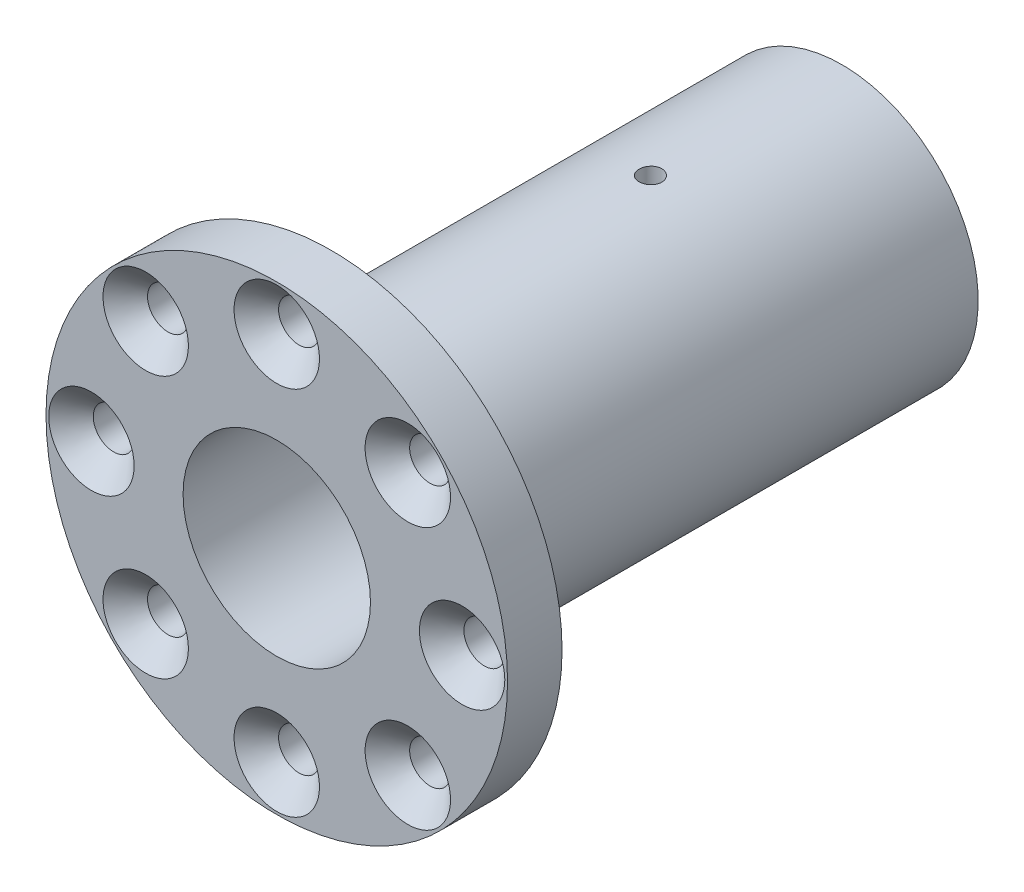
ISO-10303-21;
HEADER;
FILE_DESCRIPTION(('STEP AP214'),'2;1');
FILE_NAME('part.step','',(''),(''),'','','');
FILE_SCHEMA(('AUTOMOTIVE_DESIGN { 1 0 10303 214 1 1 1 1 }'));
ENDSEC;
DATA;
#1=APPLICATION_CONTEXT('core data for automotive mechanical design processes');
#2=APPLICATION_PROTOCOL_DEFINITION('international standard','automotive_design',2000,#1);
#3=PRODUCT_CONTEXT('',#1,'mechanical');
#4=PRODUCT('Part','Part','',(#3));
#5=PRODUCT_RELATED_PRODUCT_CATEGORY('part','',(#4));
#6=PRODUCT_DEFINITION_FORMATION('','',#4);
#7=PRODUCT_DEFINITION_CONTEXT('part definition',#1,'design');
#8=PRODUCT_DEFINITION('design','',#6,#7);
#9=PRODUCT_DEFINITION_SHAPE('','',#8);
#10=(LENGTH_UNIT() NAMED_UNIT(*) SI_UNIT(.MILLI.,.METRE.));
#11=(NAMED_UNIT(*) PLANE_ANGLE_UNIT() SI_UNIT($,.RADIAN.));
#12=(NAMED_UNIT(*) SI_UNIT($,.STERADIAN.) SOLID_ANGLE_UNIT());
#13=UNCERTAINTY_MEASURE_WITH_UNIT(LENGTH_MEASURE(1.E-05),#10,'distance_accuracy_value','');
#14=(GEOMETRIC_REPRESENTATION_CONTEXT(3) GLOBAL_UNCERTAINTY_ASSIGNED_CONTEXT((#13)) GLOBAL_UNIT_ASSIGNED_CONTEXT((#10,
#11,#12)) REPRESENTATION_CONTEXT('',''));
#15=CARTESIAN_POINT('',(0.,0.,0.));
#16=DIRECTION('',(0.,0.,1.));
#17=DIRECTION('',(1.,0.,0.));
#18=AXIS2_PLACEMENT_3D('',#15,#16,#17);
#19=CARTESIAN_POINT('',(-2.5,6.53834841531101,61.54));
#20=DIRECTION('',(-1.,0.,0.));
#21=DIRECTION('',(0.,0.,1.));
#22=AXIS2_PLACEMENT_3D('',#19,#20,#21);
#23=PLANE('',#22);
#24=DIRECTION('',(0.,1.,0.));
#25=VECTOR('',#24,1.);
#26=CARTESIAN_POINT('',(-2.5,6.53834841531101,23.44));
#27=LINE('',#26,#25);
#28=CARTESIAN_POINT('',(-2.5,6.54948151841044,23.44));
#29=VERTEX_POINT('',#28);
#30=CARTESIAN_POINT('',(-2.5,9.05849989544415,23.44));
#31=VERTEX_POINT('',#30);
#32=EDGE_CURVE('E78',#29,#31,#27,.T.);
#33=ORIENTED_EDGE('',*,*,#32,.F.);
#34=DIRECTION('',(0.,0.,-1.));
#35=VECTOR('',#34,1.);
#36=CARTESIAN_POINT('',(-2.5,6.54948151841044,61.54));
#37=LINE('',#36,#35);
#38=CARTESIAN_POINT('',(-2.5,6.54948151841044,-0.660000000000001));
#39=VERTEX_POINT('',#38);
#40=EDGE_CURVE('E83',#29,#39,#37,.T.);
#41=ORIENTED_EDGE('',*,*,#40,.T.);
#42=DIRECTION('',(0.,1.,0.));
#43=VECTOR('',#42,1.);
#44=CARTESIAN_POINT('',(-2.5,6.53834841531101,-0.660000000000001));
#45=LINE('',#44,#43);
#46=CARTESIAN_POINT('',(-2.5,9.05849989544415,-0.660000000000001));
#47=VERTEX_POINT('',#46);
#48=EDGE_CURVE('E93',#39,#47,#45,.T.);
#49=ORIENTED_EDGE('',*,*,#48,.T.);
#50=DIRECTION('',(0.,0.,-1.));
#51=VECTOR('',#50,1.);
#52=CARTESIAN_POINT('',(-2.5,9.05849989544415,61.54));
#53=LINE('',#52,#51);
#54=EDGE_CURVE('E59',#31,#47,#53,.T.);
#55=ORIENTED_EDGE('',*,*,#54,.F.);
#56=EDGE_LOOP('',(#33,#41,#49,#55));
#57=FACE_BOUND('',#56,.T.);
#58=ADVANCED_FACE('F36',(#57),#23,.F.);
#59=CARTESIAN_POINT('',(2.5,9.05849989544415,61.54));
#60=DIRECTION('',(1.,0.,0.));
#61=DIRECTION('',(0.,1.,0.));
#62=AXIS2_PLACEMENT_3D('',#59,#60,#61);
#63=PLANE('',#62);
#64=DIRECTION('',(0.,-1.,0.));
#65=VECTOR('',#64,1.);
#66=CARTESIAN_POINT('',(2.5,9.05849989544415,23.44));
#67=LINE('',#66,#65);
#68=CARTESIAN_POINT('',(2.5,9.05849989544415,23.44));
#69=VERTEX_POINT('',#68);
#70=CARTESIAN_POINT('',(2.5,6.54948151841044,23.44));
#71=VERTEX_POINT('',#70);
#72=EDGE_CURVE('E51',#69,#71,#67,.T.);
#73=ORIENTED_EDGE('',*,*,#72,.F.);
#74=DIRECTION('',(0.,0.,-1.));
#75=VECTOR('',#74,1.);
#76=CARTESIAN_POINT('',(2.5,9.05849989544415,61.54));
#77=LINE('',#76,#75);
#78=CARTESIAN_POINT('',(2.5,9.05849989544415,-0.660000000000001));
#79=VERTEX_POINT('',#78);
#80=EDGE_CURVE('E111',#69,#79,#77,.T.);
#81=ORIENTED_EDGE('',*,*,#80,.T.);
#82=DIRECTION('',(0.,-1.,0.));
#83=VECTOR('',#82,1.);
#84=CARTESIAN_POINT('',(2.5,9.05849989544415,-0.660000000000001));
#85=LINE('',#84,#83);
#86=CARTESIAN_POINT('',(2.5,6.54948151841044,-0.660000000000001));
#87=VERTEX_POINT('',#86);
#88=EDGE_CURVE('E107',#79,#87,#85,.T.);
#89=ORIENTED_EDGE('',*,*,#88,.T.);
#90=DIRECTION('',(0.,0.,-1.));
#91=VECTOR('',#90,1.);
#92=CARTESIAN_POINT('',(2.5,6.54948151841044,61.54));
#93=LINE('',#92,#91);
#94=EDGE_CURVE('E45',#87,#71,#93,.F.);
#95=ORIENTED_EDGE('',*,*,#94,.T.);
#96=EDGE_LOOP('',(#73,#81,#89,#95));
#97=FACE_BOUND('',#96,.T.);
#98=ADVANCED_FACE('F211',(#97),#63,.F.);
#99=CARTESIAN_POINT('',(-2.5,9.05849989544415,61.54));
#100=DIRECTION('',(0.,1.,0.));
#101=DIRECTION('',(0.,0.,1.));
#102=AXIS2_PLACEMENT_3D('',#99,#100,#101);
#103=PLANE('',#102);
#104=CARTESIAN_POINT('',(0.,9.05849989544415,20.422));
#105=DIRECTION('',(0.,-1.,0.));
#106=DIRECTION('',(0.,0.,-1.));
#107=AXIS2_PLACEMENT_3D('',#104,#105,#106);
#108=CIRCLE('',#107,1.24999999999999);
#109=CARTESIAN_POINT('',(0.,9.05849989544415,19.172));
#110=VERTEX_POINT('',#109);
#111=EDGE_CURVE('E144',#110,#110,#108,.T.);
#112=ORIENTED_EDGE('',*,*,#111,.F.);
#113=EDGE_LOOP('',(#112));
#114=FACE_BOUND('',#113,.T.);
#115=DIRECTION('',(1.,0.,0.));
#116=VECTOR('',#115,1.);
#117=CARTESIAN_POINT('',(-2.5,9.05849989544415,23.44));
#118=LINE('',#117,#116);
#119=EDGE_CURVE('E86',#31,#69,#118,.T.);
#120=ORIENTED_EDGE('',*,*,#119,.F.);
#121=ORIENTED_EDGE('',*,*,#54,.T.);
#122=DIRECTION('',(1.,0.,0.));
#123=VECTOR('',#122,1.);
#124=CARTESIAN_POINT('',(-2.5,9.05849989544415,-0.660000000000001));
#125=LINE('',#124,#123);
#126=EDGE_CURVE('E98',#47,#79,#125,.T.);
#127=ORIENTED_EDGE('',*,*,#126,.T.);
#128=ORIENTED_EDGE('',*,*,#80,.F.);
#129=EDGE_LOOP('',(#120,#121,#127,#128));
#130=FACE_BOUND('',#129,.T.);
#131=ADVANCED_FACE('F210',(#114,#130),#103,.F.);
#132=CARTESIAN_POINT('',(0.,0.,61.54));
#133=DIRECTION('',(0.,0.,-1.));
#134=DIRECTION('',(-1.,0.,0.));
#135=AXIS2_PLACEMENT_3D('',#132,#133,#134);
#136=CYLINDRICAL_SURFACE('',#135,7.01039999999999);
#137=CARTESIAN_POINT('',(0.,0.,23.44));
#138=DIRECTION('',(0.,0.,1.));
#139=DIRECTION('',(1.,0.,0.));
#140=AXIS2_PLACEMENT_3D('',#137,#138,#139);
#141=CIRCLE('',#140,7.01039999999999);
#142=EDGE_CURVE('E11',#71,#29,#141,.F.);
#143=ORIENTED_EDGE('',*,*,#142,.F.);
#144=ORIENTED_EDGE('',*,*,#94,.F.);
#145=CARTESIAN_POINT('',(0.,0.,-0.660000000000001));
#146=DIRECTION('',(0.,0.,-1.));
#147=DIRECTION('',(-1.,0.,0.));
#148=AXIS2_PLACEMENT_3D('',#145,#146,#147);
#149=CIRCLE('',#148,7.01039999999999);
#150=EDGE_CURVE('E90',#87,#39,#149,.T.);
#151=ORIENTED_EDGE('',*,*,#150,.T.);
#152=ORIENTED_EDGE('',*,*,#40,.F.);
#153=EDGE_LOOP('',(#143,#144,#151,#152));
#154=FACE_BOUND('',#153,.T.);
#155=ADVANCED_FACE('F88',(#154),#136,.F.);
#156=CARTESIAN_POINT('',(0.,0.,61.54));
#157=DIRECTION('',(0.,0.,-1.));
#158=DIRECTION('',(-1.,0.,0.));
#159=AXIS2_PLACEMENT_3D('',#156,#157,#158);
#160=CYLINDRICAL_SURFACE('',#159,25.4);
#161=CARTESIAN_POINT('',(0.,0.,61.54));
#162=DIRECTION('',(0.,0.,-1.));
#163=DIRECTION('',(-1.,0.,0.));
#164=AXIS2_PLACEMENT_3D('',#161,#162,#163);
#165=CIRCLE('',#164,25.4);
#166=CARTESIAN_POINT('',(-25.4,0.,61.54));
#167=VERTEX_POINT('',#166);
#168=EDGE_CURVE('E128',#167,#167,#165,.T.);
#169=ORIENTED_EDGE('',*,*,#168,.T.);
#170=EDGE_LOOP('',(#169));
#171=FACE_BOUND('',#170,.T.);
#172=CARTESIAN_POINT('',(0.,0.,55.54));
#173=DIRECTION('',(0.,0.,-1.));
#174=DIRECTION('',(-1.,0.,0.));
#175=AXIS2_PLACEMENT_3D('',#172,#173,#174);
#176=CIRCLE('',#175,25.4);
#177=CARTESIAN_POINT('',(-25.4,0.,55.54));
#178=VERTEX_POINT('',#177);
#179=EDGE_CURVE('E121',#178,#178,#176,.T.);
#180=ORIENTED_EDGE('',*,*,#179,.F.);
#181=EDGE_LOOP('',(#180));
#182=FACE_BOUND('',#181,.T.);
#183=ADVANCED_FACE('F38',(#171,#182),#160,.T.);
#184=CARTESIAN_POINT('',(25.4,0.,61.54));
#185=DIRECTION('',(0.,0.,1.));
#186=DIRECTION('',(1.,0.,0.));
#187=AXIS2_PLACEMENT_3D('',#184,#185,#186);
#188=PLANE('',#187);
#189=CARTESIAN_POINT('',(0.,0.,61.54));
#190=DIRECTION('',(0.,0.,1.));
#191=DIRECTION('',(1.,0.,0.));
#192=AXIS2_PLACEMENT_3D('',#189,#190,#191);
#193=CIRCLE('',#192,10.3124);
#194=CARTESIAN_POINT('',(10.3124,0.,61.54));
#195=VERTEX_POINT('',#194);
#196=EDGE_CURVE('E275',#195,#195,#193,.T.);
#197=ORIENTED_EDGE('',*,*,#196,.F.);
#198=EDGE_LOOP('',(#197));
#199=FACE_BOUND('',#198,.T.);
#200=CARTESIAN_POINT('',(0.,20.4,61.54));
#201=DIRECTION('',(0.,0.,1.));
#202=DIRECTION('',(1.,0.,0.));
#203=AXIS2_PLACEMENT_3D('',#200,#201,#202);
#204=CIRCLE('',#203,4.70000000001392);
#205=CARTESIAN_POINT('',(4.70000000001392,20.4,61.54));
#206=VERTEX_POINT('',#205);
#207=EDGE_CURVE('E279',#206,#206,#204,.T.);
#208=ORIENTED_EDGE('',*,*,#207,.F.);
#209=EDGE_LOOP('',(#208));
#210=FACE_BOUND('',#209,.T.);
#211=CARTESIAN_POINT('',(14.4249783362061,14.4249783362068,61.54));
#212=DIRECTION('',(0.,0.,1.));
#213=DIRECTION('',(1.,0.,0.));
#214=AXIS2_PLACEMENT_3D('',#211,#212,#213);
#215=CIRCLE('',#214,4.70000000001391);
#216=CARTESIAN_POINT('',(19.12497833622,14.4249783362068,61.54));
#217=VERTEX_POINT('',#216);
#218=EDGE_CURVE('E283',#217,#217,#215,.T.);
#219=ORIENTED_EDGE('',*,*,#218,.F.);
#220=EDGE_LOOP('',(#219));
#221=FACE_BOUND('',#220,.T.);
#222=CARTESIAN_POINT('',(20.4000000000017,1.73691033767046E-12,61.54));
#223=DIRECTION('',(0.,0.,1.));
#224=DIRECTION('',(1.,0.,0.));
#225=AXIS2_PLACEMENT_3D('',#222,#223,#224);
#226=CIRCLE('',#225,4.70000000001392);
#227=CARTESIAN_POINT('',(25.1000000000156,1.73691033767046E-12,61.54));
#228=VERTEX_POINT('',#227);
#229=EDGE_CURVE('E287',#228,#228,#226,.T.);
#230=ORIENTED_EDGE('',*,*,#229,.F.);
#231=EDGE_LOOP('',(#230));
#232=FACE_BOUND('',#231,.T.);
#233=CARTESIAN_POINT('',(14.4249783362085,-14.4249783362043,61.54));
#234=DIRECTION('',(0.,0.,1.));
#235=DIRECTION('',(1.,0.,0.));
#236=AXIS2_PLACEMENT_3D('',#233,#234,#235);
#237=CIRCLE('',#236,4.70000000001392);
#238=CARTESIAN_POINT('',(19.1249783362224,-14.4249783362043,61.54));
#239=VERTEX_POINT('',#238);
#240=EDGE_CURVE('E291',#239,#239,#237,.T.);
#241=ORIENTED_EDGE('',*,*,#240,.F.);
#242=EDGE_LOOP('',(#241));
#243=FACE_BOUND('',#242,.T.);
#244=CARTESIAN_POINT('',(3.47378376064356E-12,-20.4,61.54));
#245=DIRECTION('',(0.,0.,1.));
#246=DIRECTION('',(1.,0.,0.));
#247=AXIS2_PLACEMENT_3D('',#244,#245,#246);
#248=CIRCLE('',#247,4.70000000001392);
#249=CARTESIAN_POINT('',(4.70000000001739,-20.4,61.54));
#250=VERTEX_POINT('',#249);
#251=EDGE_CURVE('E295',#250,#250,#248,.T.);
#252=ORIENTED_EDGE('',*,*,#251,.F.);
#253=EDGE_LOOP('',(#252));
#254=FACE_BOUND('',#253,.T.);
#255=CARTESIAN_POINT('',(-14.4249783362026,-14.4249783362068,61.54));
#256=DIRECTION('',(0.,0.,1.));
#257=DIRECTION('',(1.,0.,0.));
#258=AXIS2_PLACEMENT_3D('',#255,#256,#257);
#259=CIRCLE('',#258,4.70000000001392);
#260=CARTESIAN_POINT('',(-9.72497833618869,-14.4249783362068,61.54));
#261=VERTEX_POINT('',#260);
#262=EDGE_CURVE('E299',#261,#261,#259,.T.);
#263=ORIENTED_EDGE('',*,*,#262,.F.);
#264=EDGE_LOOP('',(#263));
#265=FACE_BOUND('',#264,.T.);
#266=CARTESIAN_POINT('',(-20.3999999999983,-1.73940861714072E-12,61.54));
#267=DIRECTION('',(0.,0.,1.));
#268=DIRECTION('',(1.,0.,0.));
#269=AXIS2_PLACEMENT_3D('',#266,#267,#268);
#270=CIRCLE('',#269,4.70000000001392);
#271=CARTESIAN_POINT('',(-15.6999999999844,-1.73940861714072E-12,61.54));
#272=VERTEX_POINT('',#271);
#273=EDGE_CURVE('E303',#272,#272,#270,.T.);
#274=ORIENTED_EDGE('',*,*,#273,.F.);
#275=EDGE_LOOP('',(#274));
#276=FACE_BOUND('',#275,.T.);
#277=CARTESIAN_POINT('',(-14.4249783362051,14.4249783362043,61.54));
#278=DIRECTION('',(0.,0.,1.));
#279=DIRECTION('',(1.,0.,0.));
#280=AXIS2_PLACEMENT_3D('',#277,#278,#279);
#281=CIRCLE('',#280,4.70000000001392);
#282=CARTESIAN_POINT('',(-9.72497833619114,14.4249783362043,61.54));
#283=VERTEX_POINT('',#282);
#284=EDGE_CURVE('E306',#283,#283,#281,.T.);
#285=ORIENTED_EDGE('',*,*,#284,.F.);
#286=EDGE_LOOP('',(#285));
#287=FACE_BOUND('',#286,.T.);
#288=ORIENTED_EDGE('',*,*,#168,.F.);
#289=EDGE_LOOP('',(#288));
#290=FACE_BOUND('',#289,.T.);
#291=ADVANCED_FACE('F258',(#199,#210,#221,#232,#243,#254,#265,#276,#287,#290),#188,.T.);
#292=CARTESIAN_POINT('',(0.,0.,55.54));
#293=DIRECTION('',(0.,0.,-1.));
#294=DIRECTION('',(-1.,0.,0.));
#295=AXIS2_PLACEMENT_3D('',#292,#293,#294);
#296=PLANE('',#295);
#297=CARTESIAN_POINT('',(0.,20.4,55.54));
#298=DIRECTION('',(0.,0.,-1.));
#299=DIRECTION('',(-1.,0.,0.));
#300=AXIS2_PLACEMENT_3D('',#297,#298,#299);
#301=CIRCLE('',#300,2.24999999999998);
#302=CARTESIAN_POINT('',(-2.24999999999998,20.4,55.54));
#303=VERTEX_POINT('',#302);
#304=EDGE_CURVE('E409',#303,#303,#301,.T.);
#305=ORIENTED_EDGE('',*,*,#304,.F.);
#306=EDGE_LOOP('',(#305));
#307=FACE_BOUND('',#306,.T.);
#308=CARTESIAN_POINT('',(14.4249783362061,14.4249783362068,55.54));
#309=DIRECTION('',(0.,0.,-1.));
#310=DIRECTION('',(-1.,0.,0.));
#311=AXIS2_PLACEMENT_3D('',#308,#309,#310);
#312=CIRCLE('',#311,2.24999999999998);
#313=CARTESIAN_POINT('',(12.1749783362061,14.4249783362068,55.54));
#314=VERTEX_POINT('',#313);
#315=EDGE_CURVE('E405',#314,#314,#312,.T.);
#316=ORIENTED_EDGE('',*,*,#315,.F.);
#317=EDGE_LOOP('',(#316));
#318=FACE_BOUND('',#317,.T.);
#319=CARTESIAN_POINT('',(20.4000000000017,1.73691033767046E-12,55.54));
#320=DIRECTION('',(0.,0.,-1.));
#321=DIRECTION('',(-1.,0.,0.));
#322=AXIS2_PLACEMENT_3D('',#319,#320,#321);
#323=CIRCLE('',#322,2.24999999999998);
#324=CARTESIAN_POINT('',(18.1500000000018,1.73691033767046E-12,55.54));
#325=VERTEX_POINT('',#324);
#326=EDGE_CURVE('E367',#325,#325,#323,.T.);
#327=ORIENTED_EDGE('',*,*,#326,.F.);
#328=EDGE_LOOP('',(#327));
#329=FACE_BOUND('',#328,.T.);
#330=CARTESIAN_POINT('',(14.4249783362085,-14.4249783362043,55.54));
#331=DIRECTION('',(0.,0.,-1.));
#332=DIRECTION('',(-1.,0.,0.));
#333=AXIS2_PLACEMENT_3D('',#330,#331,#332);
#334=CIRCLE('',#333,2.24999999999998);
#335=CARTESIAN_POINT('',(12.1749783362086,-14.4249783362043,55.54));
#336=VERTEX_POINT('',#335);
#337=EDGE_CURVE('E363',#336,#336,#334,.T.);
#338=ORIENTED_EDGE('',*,*,#337,.F.);
#339=EDGE_LOOP('',(#338));
#340=FACE_BOUND('',#339,.T.);
#341=CARTESIAN_POINT('',(3.47378376064356E-12,-20.4,55.54));
#342=DIRECTION('',(0.,0.,-1.));
#343=DIRECTION('',(-1.,0.,0.));
#344=AXIS2_PLACEMENT_3D('',#341,#342,#343);
#345=CIRCLE('',#344,2.24999999999998);
#346=CARTESIAN_POINT('',(-2.24999999999651,-20.4,55.54));
#347=VERTEX_POINT('',#346);
#348=EDGE_CURVE('E382',#347,#347,#345,.T.);
#349=ORIENTED_EDGE('',*,*,#348,.F.);
#350=EDGE_LOOP('',(#349));
#351=FACE_BOUND('',#350,.T.);
#352=CARTESIAN_POINT('',(-14.4249783362026,-14.4249783362068,55.54));
#353=DIRECTION('',(0.,0.,-1.));
#354=DIRECTION('',(-1.,0.,0.));
#355=AXIS2_PLACEMENT_3D('',#352,#353,#354);
#356=CIRCLE('',#355,2.24999999999998);
#357=CARTESIAN_POINT('',(-16.6749783362026,-14.4249783362068,55.54));
#358=VERTEX_POINT('',#357);
#359=EDGE_CURVE('E388',#358,#358,#356,.T.);
#360=ORIENTED_EDGE('',*,*,#359,.F.);
#361=EDGE_LOOP('',(#360));
#362=FACE_BOUND('',#361,.T.);
#363=CARTESIAN_POINT('',(-20.3999999999983,-1.73940861714072E-12,55.54));
#364=DIRECTION('',(0.,0.,-1.));
#365=DIRECTION('',(-1.,0.,0.));
#366=AXIS2_PLACEMENT_3D('',#363,#364,#365);
#367=CIRCLE('',#366,2.24999999999998);
#368=CARTESIAN_POINT('',(-22.6499999999982,-1.73940861714072E-12,55.54));
#369=VERTEX_POINT('',#368);
#370=EDGE_CURVE('E310',#369,#369,#367,.T.);
#371=ORIENTED_EDGE('',*,*,#370,.F.);
#372=EDGE_LOOP('',(#371));
#373=FACE_BOUND('',#372,.T.);
#374=CARTESIAN_POINT('',(-14.4249783362051,14.4249783362043,55.54));
#375=DIRECTION('',(0.,0.,-1.));
#376=DIRECTION('',(-1.,0.,0.));
#377=AXIS2_PLACEMENT_3D('',#374,#375,#376);
#378=CIRCLE('',#377,2.24999999999998);
#379=CARTESIAN_POINT('',(-16.674978336205,14.4249783362043,55.54));
#380=VERTEX_POINT('',#379);
#381=EDGE_CURVE('E145',#380,#380,#378,.T.);
#382=ORIENTED_EDGE('',*,*,#381,.F.);
#383=EDGE_LOOP('',(#382));
#384=FACE_BOUND('',#383,.T.);
#385=CARTESIAN_POINT('',(0.,0.,55.54));
#386=DIRECTION('',(0.,0.,-1.));
#387=DIRECTION('',(-1.,0.,0.));
#388=AXIS2_PLACEMENT_3D('',#385,#386,#387);
#389=CIRCLE('',#388,15.);
#390=CARTESIAN_POINT('',(-15.,0.,55.54));
#391=VERTEX_POINT('',#390);
#392=EDGE_CURVE('E114',#391,#391,#389,.T.);
#393=ORIENTED_EDGE('',*,*,#392,.F.);
#394=EDGE_LOOP('',(#393));
#395=FACE_BOUND('',#394,.T.);
#396=ORIENTED_EDGE('',*,*,#179,.T.);
#397=EDGE_LOOP('',(#396));
#398=FACE_BOUND('',#397,.T.);
#399=ADVANCED_FACE('F224',(#307,#318,#329,#340,#351,#362,#373,#384,#395,#398),#296,.T.);
#400=CARTESIAN_POINT('',(0.,0.,-0.660000000000001));
#401=DIRECTION('',(0.,0.,1.));
#402=DIRECTION('',(1.,0.,0.));
#403=AXIS2_PLACEMENT_3D('',#400,#401,#402);
#404=CYLINDRICAL_SURFACE('',#403,15.);
#405=CARTESIAN_POINT('',(0.,15.,19.172));
#406=CARTESIAN_POINT('',(0.0700826124015046,14.999999317644,19.1720030610329));
#407=CARTESIAN_POINT('',(0.140212933975281,14.9995036067925,19.1779137122638));
#408=CARTESIAN_POINT('',(0.278533213375484,14.9975737791031,19.2014054398189));
#409=CARTESIAN_POINT('',(0.346720881531534,14.9961385991462,19.2189997378811));
#410=CARTESIAN_POINT('',(0.479132528142821,14.9924920155763,19.2653464422617));
#411=CARTESIAN_POINT('',(0.543358725530763,14.9902810512311,19.2940925351373));
#412=CARTESIAN_POINT('',(0.666059041770088,14.9853308468089,19.36191553984));
#413=CARTESIAN_POINT('',(0.724534387356729,14.982591719767,19.4009902418469));
#414=CARTESIAN_POINT('',(0.83423749995698,14.9768847483339,19.4884688332575));
#415=CARTESIAN_POINT('',(0.885448590520192,14.9739164010822,19.5368936049196));
#416=CARTESIAN_POINT('',(0.979026416920682,14.9680897600396,19.6416536198124));
#417=CARTESIAN_POINT('',(1.02139276421437,14.965231471088,19.6979892103783));
#418=CARTESIAN_POINT('',(1.09613490298778,14.9599431582655,19.8170726463738));
#419=CARTESIAN_POINT('',(1.12849604118942,14.9575137647512,19.8798297192535));
#420=CARTESIAN_POINT('',(1.18221554221729,14.9533640556034,20.009910369445));
#421=CARTESIAN_POINT('',(1.20357409939051,14.9516437274454,20.0772338660728));
#422=CARTESIAN_POINT('',(1.2346337872732,14.949111150829,20.2143692398515));
#423=CARTESIAN_POINT('',(1.24436208173721,14.9482967867028,20.2841749249908));
#424=CARTESIAN_POINT('',(1.25196901001927,14.9476616540185,20.4244327549317));
#425=CARTESIAN_POINT('',(1.24984786622441,14.9478408668133,20.4948848875763));
#426=CARTESIAN_POINT('',(1.23383858026855,14.9491707170205,20.6342495818882));
#427=CARTESIAN_POINT('',(1.21997996004756,14.9503189172232,20.7031655613455));
#428=CARTESIAN_POINT('',(1.18093498172866,14.9534535446171,20.8376898342412));
#429=CARTESIAN_POINT('',(1.15574851299597,14.955439979995,20.9032980953673));
#430=CARTESIAN_POINT('',(1.09472973519003,14.9600300588357,21.0294386323476));
#431=CARTESIAN_POINT('',(1.05888418094648,14.9626344693871,21.0899644719844));
#432=CARTESIAN_POINT('',(0.977574304891675,14.9681663357985,21.2041516735248));
#433=CARTESIAN_POINT('',(0.932109788278167,14.9710937982004,21.2578128963715));
#434=CARTESIAN_POINT('',(0.832686977782944,14.9769527551456,21.3569192741019));
#435=CARTESIAN_POINT('',(0.77870316173821,14.9798842346883,21.4023388301616));
#436=CARTESIAN_POINT('',(0.663863195464681,14.9854123983729,21.4834746542357));
#437=CARTESIAN_POINT('',(0.603007040644165,14.9880090822911,21.5191909157669));
#438=CARTESIAN_POINT('',(0.476133241584809,14.9925755726205,21.5799047033359));
#439=CARTESIAN_POINT('',(0.410115052261338,14.9945453127181,21.6049010955977));
#440=CARTESIAN_POINT('',(0.274798836274474,14.9976352176475,21.6434476655641));
#441=CARTESIAN_POINT('',(0.205500877711066,14.9987554001111,21.6569980808191));
#442=CARTESIAN_POINT('',(0.0658141252053123,15.0000177117881,21.672235955052));
#443=CARTESIAN_POINT('',(-0.0045707863939955,15.00016275615,21.6739587726336));
#444=CARTESIAN_POINT('',(-0.144628440629128,14.9994662347338,21.6655851742158));
#445=CARTESIAN_POINT('',(-0.214301189901765,14.9986246781584,21.6554888684632));
#446=CARTESIAN_POINT('',(-0.350855945280871,14.9960514730165,21.6237929267374));
#447=CARTESIAN_POINT('',(-0.417741781424648,14.9943210927178,21.6022096799677));
#448=CARTESIAN_POINT('',(-0.546942706353105,14.9901646264044,21.5481692652724));
#449=CARTESIAN_POINT('',(-0.609257722853909,14.9877385293905,21.5157119254269));
#450=CARTESIAN_POINT('',(-0.727709022877376,14.9824553299204,21.4407558134795));
#451=CARTESIAN_POINT('',(-0.783830438151828,14.9795972277342,21.3982336170065));
#452=CARTESIAN_POINT('',(-0.888151368554517,14.9737744829962,21.3043886786869));
#453=CARTESIAN_POINT('',(-0.93635074601797,14.9708098385941,21.2530657839384));
#454=CARTESIAN_POINT('',(-1.02358068181887,14.9650995151978,21.1429228847521));
#455=CARTESIAN_POINT('',(-1.06258816654204,14.9623543984278,21.0840845735032));
#456=CARTESIAN_POINT('',(-1.13016882854939,14.957401896804,20.9606721714207));
#457=CARTESIAN_POINT('',(-1.15874211001244,14.9551945065815,20.8960981378626));
#458=CARTESIAN_POINT('',(-1.20460397180069,14.9515705356118,20.7631290118259));
#459=CARTESIAN_POINT('',(-1.2219066768116,14.9501529653579,20.6947388191071));
#460=CARTESIAN_POINT('',(-1.24478221238768,14.9482658211357,20.556011625157));
#461=CARTESIAN_POINT('',(-1.25035526821032,14.9477962289621,20.485674661338));
#462=CARTESIAN_POINT('',(-1.24961070361365,14.9478584743774,20.3452798424739));
#463=CARTESIAN_POINT('',(-1.24332933722173,14.9483872586634,20.2752217909545));
#464=CARTESIAN_POINT('',(-1.21912982911878,14.9503801885288,20.1371593330614));
#465=CARTESIAN_POINT('',(-1.20121166965952,14.951844335535,20.0691549298202));
#466=CARTESIAN_POINT('',(-1.15425638752132,14.9555422141463,19.9371277959167));
#467=CARTESIAN_POINT('',(-1.12521991750816,14.9577759005774,19.8731048317929));
#468=CARTESIAN_POINT('',(-1.05685632368405,14.9627612484384,19.7508364492829));
#469=CARTESIAN_POINT('',(-1.01752936139319,14.9655129017381,19.6925909402333));
#470=CARTESIAN_POINT('',(-0.929564927653049,14.9712341462335,19.5833453262337));
#471=CARTESIAN_POINT('',(-0.880900617176813,14.9742043500718,19.5323668641783));
#472=CARTESIAN_POINT('',(-0.775691531990572,14.980022437621,19.4392810184959));
#473=CARTESIAN_POINT('',(-0.719144853301355,14.9828702915603,19.39717578438));
#474=CARTESIAN_POINT('',(-0.59966721628676,14.9881279355284,19.3229751744781));
#475=CARTESIAN_POINT('',(-0.536724570338166,14.9905369002888,19.2908985766796));
#476=CARTESIAN_POINT('',(-0.406369689994662,14.9946356564538,19.2378102461859));
#477=CARTESIAN_POINT('',(-0.33896269426706,14.9963262741032,19.2167857946399));
#478=CARTESIAN_POINT('',(-0.225965060120847,14.9983638466732,19.1917530218725));
#479=CARTESIAN_POINT('',(-0.181101118048087,14.9989746109619,19.1843554843532));
#480=CARTESIAN_POINT('',(-0.0908314643764523,14.9997929082329,19.1744779879035));
#481=CARTESIAN_POINT('',(-0.0454257542163059,15.0000004422857,19.1719980159169));
#482=CARTESIAN_POINT('',(0.,15.,19.172));
#483=B_SPLINE_CURVE_WITH_KNOTS('',3,(#405,#406,#407,#408,#409,#410,#411,#412,#413,#414,#415,
#416,#417,#418,#419,#420,#421,#422,#423,#424,#425,#426,#427,#428,#429,#430,#431,#432,#433,#434,
#435,#436,#437,#438,#439,#440,#441,#442,#443,#444,#445,#446,#447,#448,#449,#450,#451,#452,#453,
#454,#455,#456,#457,#458,#459,#460,#461,#462,#463,#464,#465,#466,#467,#468,#469,#470,#471,#472,
#473,#474,#475,#476,#477,#478,#479,#480,#481,#482),.UNSPECIFIED.,.T.,.F.,(4,2,2,2,2,2,2,2,2,2,2,
2,2,2,2,2,2,2,2,2,2,2,2,2,2,2,2,2,2,2,2,2,2,2,2,2,2,2,4),(0.,0.210081983500172,0.42040211124729,
0.630603342361185,0.840759636980218,1.05139083598219,1.26203128592413,1.47297878688863,
1.68392256159874,1.89437268539481,2.10481885953272,2.3147372888786,2.52465776846246,
2.73484019686122,2.94502688226072,3.15585563668934,3.36668453198303,3.57753571988059,
3.78838253165665,3.99859874133957,4.20881299017772,4.41872811288477,4.62864655451711,
4.83905843718653,5.04947397589058,5.26041220613997,5.4713483302478,5.68201959051155,
5.89268680498441,6.10271078603153,6.31273508740418,6.52274706184397,6.73275574012314,
6.94337735830792,7.15404994040594,7.36511466328185,7.57593595739724,7.7121060794582,
7.84827583998425),.UNSPECIFIED.);
#484=CARTESIAN_POINT('',(0.,15.,19.172));
#485=VERTEX_POINT('',#484);
#486=EDGE_CURVE('E134',#485,#485,#483,.T.);
#487=ORIENTED_EDGE('',*,*,#486,.T.);
#488=EDGE_LOOP('',(#487));
#489=FACE_BOUND('',#488,.T.);
#490=CARTESIAN_POINT('',(0.,0.,-0.660000000000001));
#491=DIRECTION('',(0.,0.,-1.));
#492=DIRECTION('',(-1.,0.,0.));
#493=AXIS2_PLACEMENT_3D('',#490,#491,#492);
#494=CIRCLE('',#493,15.);
#495=CARTESIAN_POINT('',(-15.,0.,-0.660000000000001));
#496=VERTEX_POINT('',#495);
#497=EDGE_CURVE('E117',#496,#496,#494,.T.);
#498=ORIENTED_EDGE('',*,*,#497,.F.);
#499=EDGE_LOOP('',(#498));
#500=FACE_BOUND('',#499,.T.);
#501=ORIENTED_EDGE('',*,*,#392,.T.);
#502=EDGE_LOOP('',(#501));
#503=FACE_BOUND('',#502,.T.);
#504=ADVANCED_FACE('F147',(#489,#500,#503),#404,.T.);
#505=CARTESIAN_POINT('',(0.,0.,-0.660000000000001));
#506=DIRECTION('',(0.,0.,-1.));
#507=DIRECTION('',(-1.,0.,0.));
#508=AXIS2_PLACEMENT_3D('',#505,#506,#507);
#509=PLANE('',#508);
#510=CARTESIAN_POINT('',(11.4999999999991,-7.61616736356426E-13,-0.660000000000002));
#511=DIRECTION('',(0.,0.,-1.));
#512=DIRECTION('',(-1.,0.,0.));
#513=AXIS2_PLACEMENT_3D('',#510,#511,#512);
#514=CIRCLE('',#513,1.24999999999999);
#515=CARTESIAN_POINT('',(10.2499999999991,-7.61616736356426E-13,-0.660000000000002));
#516=VERTEX_POINT('',#515);
#517=EDGE_CURVE('E143',#516,#516,#514,.T.);
#518=ORIENTED_EDGE('',*,*,#517,.F.);
#519=EDGE_LOOP('',(#518));
#520=FACE_BOUND('',#519,.T.);
#521=CARTESIAN_POINT('',(5.74999999999794,-9.95929214352135,-0.660000000000002));
#522=DIRECTION('',(0.,0.,-1.));
#523=DIRECTION('',(-1.,0.,0.));
#524=AXIS2_PLACEMENT_3D('',#521,#522,#523);
#525=CIRCLE('',#524,1.24999999999999);
#526=CARTESIAN_POINT('',(4.49999999999795,-9.95929214352135,-0.660000000000002));
#527=VERTEX_POINT('',#526);
#528=EDGE_CURVE('E232',#527,#527,#525,.T.);
#529=ORIENTED_EDGE('',*,*,#528,.F.);
#530=EDGE_LOOP('',(#529));
#531=FACE_BOUND('',#530,.T.);
#532=CARTESIAN_POINT('',(-5.75000000000222,-9.95929214352015,-0.660000000000002));
#533=DIRECTION('',(0.,0.,-1.));
#534=DIRECTION('',(-1.,0.,0.));
#535=AXIS2_PLACEMENT_3D('',#532,#533,#534);
#536=CIRCLE('',#535,1.24999999999999);
#537=CARTESIAN_POINT('',(-7.00000000000221,-9.95929214352015,-0.660000000000002));
#538=VERTEX_POINT('',#537);
#539=EDGE_CURVE('E236',#538,#538,#536,.T.);
#540=ORIENTED_EDGE('',*,*,#539,.F.);
#541=EDGE_LOOP('',(#540));
#542=FACE_BOUND('',#541,.T.);
#543=CARTESIAN_POINT('',(-11.5000000000013,1.64225995095778E-12,-0.660000000000002));
#544=DIRECTION('',(0.,0.,-1.));
#545=DIRECTION('',(-1.,0.,0.));
#546=AXIS2_PLACEMENT_3D('',#543,#544,#545);
#547=CIRCLE('',#546,1.24999999999999);
#548=CARTESIAN_POINT('',(-12.7500000000013,1.64225995095778E-12,-0.660000000000002));
#549=VERTEX_POINT('',#548);
#550=EDGE_CURVE('E240',#549,#549,#547,.T.);
#551=ORIENTED_EDGE('',*,*,#550,.F.);
#552=EDGE_LOOP('',(#551));
#553=FACE_BOUND('',#552,.T.);
#554=CARTESIAN_POINT('',(-5.75000000000015,9.95929214352223,-0.660000000000002));
#555=DIRECTION('',(0.,0.,-1.));
#556=DIRECTION('',(-1.,0.,0.));
#557=AXIS2_PLACEMENT_3D('',#554,#555,#556);
#558=CIRCLE('',#557,1.24999999999999);
#559=CARTESIAN_POINT('',(-7.00000000000014,9.95929214352223,-0.660000000000002));
#560=VERTEX_POINT('',#559);
#561=EDGE_CURVE('E244',#560,#560,#558,.T.);
#562=ORIENTED_EDGE('',*,*,#561,.F.);
#563=EDGE_LOOP('',(#562));
#564=FACE_BOUND('',#563,.T.);
#565=CARTESIAN_POINT('',(5.75000000000002,9.95929214352104,-0.660000000000002));
#566=DIRECTION('',(0.,0.,-1.));
#567=DIRECTION('',(-1.,0.,0.));
#568=AXIS2_PLACEMENT_3D('',#565,#566,#567);
#569=CIRCLE('',#568,1.24999999999999);
#570=CARTESIAN_POINT('',(4.50000000000003,9.95929214352104,-0.660000000000002));
#571=VERTEX_POINT('',#570);
#572=EDGE_CURVE('E248',#571,#571,#569,.T.);
#573=ORIENTED_EDGE('',*,*,#572,.F.);
#574=EDGE_LOOP('',(#573));
#575=FACE_BOUND('',#574,.T.);
#576=ORIENTED_EDGE('',*,*,#150,.F.);
#577=ORIENTED_EDGE('',*,*,#88,.F.);
#578=ORIENTED_EDGE('',*,*,#126,.F.);
#579=ORIENTED_EDGE('',*,*,#48,.F.);
#580=EDGE_LOOP('',(#576,#577,#578,#579));
#581=FACE_BOUND('',#580,.T.);
#582=ORIENTED_EDGE('',*,*,#497,.T.);
#583=EDGE_LOOP('',(#582));
#584=FACE_BOUND('',#583,.T.);
#585=ADVANCED_FACE('F206',(#520,#531,#542,#553,#564,#575,#581,#584),#509,.T.);
#586=CARTESIAN_POINT('',(5.75000000000001,9.95929214352104,11.34));
#587=DIRECTION('',(0.,0.,1.));
#588=DIRECTION('',(1.,0.,0.));
#589=AXIS2_PLACEMENT_3D('',#586,#587,#588);
#590=PLANE('',#589);
#591=CARTESIAN_POINT('',(5.75000000000002,9.95929214352104,11.34));
#592=DIRECTION('',(0.,0.,-1.));
#593=DIRECTION('',(-1.,0.,0.));
#594=AXIS2_PLACEMENT_3D('',#591,#592,#593);
#595=CIRCLE('',#594,1.24999999999999);
#596=CARTESIAN_POINT('',(4.50000000000003,9.95929214352104,11.34));
#597=VERTEX_POINT('',#596);
#598=EDGE_CURVE('E101',#597,#597,#595,.T.);
#599=ORIENTED_EDGE('',*,*,#598,.T.);
#600=EDGE_LOOP('',(#599));
#601=FACE_BOUND('',#600,.T.);
#602=ADVANCED_FACE('F202',(#601),#590,.F.);
#603=CARTESIAN_POINT('',(5.75000000000002,9.95929214352104,-0.660000000000001));
#604=DIRECTION('',(0.,0.,-1.));
#605=DIRECTION('',(-1.,0.,0.));
#606=AXIS2_PLACEMENT_3D('',#603,#604,#605);
#607=CYLINDRICAL_SURFACE('',#606,1.24999999999999);
#608=ORIENTED_EDGE('',*,*,#598,.F.);
#609=EDGE_LOOP('',(#608));
#610=FACE_BOUND('',#609,.T.);
#611=ORIENTED_EDGE('',*,*,#572,.T.);
#612=EDGE_LOOP('',(#611));
#613=FACE_BOUND('',#612,.T.);
#614=ADVANCED_FACE('F198',(#610,#613),#607,.F.);
#615=CARTESIAN_POINT('',(-5.75000000000015,9.95929214352223,11.34));
#616=DIRECTION('',(0.,0.,1.));
#617=DIRECTION('',(1.,0.,0.));
#618=AXIS2_PLACEMENT_3D('',#615,#616,#617);
#619=PLANE('',#618);
#620=CARTESIAN_POINT('',(-5.75000000000015,9.95929214352223,11.34));
#621=DIRECTION('',(0.,0.,-1.));
#622=DIRECTION('',(-1.,0.,0.));
#623=AXIS2_PLACEMENT_3D('',#620,#621,#622);
#624=CIRCLE('',#623,1.24999999999999);
#625=CARTESIAN_POINT('',(-7.00000000000014,9.95929214352223,11.34));
#626=VERTEX_POINT('',#625);
#627=EDGE_CURVE('E351',#626,#626,#624,.T.);
#628=ORIENTED_EDGE('',*,*,#627,.T.);
#629=EDGE_LOOP('',(#628));
#630=FACE_BOUND('',#629,.T.);
#631=ADVANCED_FACE('F194',(#630),#619,.F.);
#632=CARTESIAN_POINT('',(-5.75000000000015,9.95929214352223,-0.660000000000001));
#633=DIRECTION('',(0.,0.,-1.));
#634=DIRECTION('',(-1.,0.,0.));
#635=AXIS2_PLACEMENT_3D('',#632,#633,#634);
#636=CYLINDRICAL_SURFACE('',#635,1.24999999999999);
#637=ORIENTED_EDGE('',*,*,#627,.F.);
#638=EDGE_LOOP('',(#637));
#639=FACE_BOUND('',#638,.T.);
#640=ORIENTED_EDGE('',*,*,#561,.T.);
#641=EDGE_LOOP('',(#640));
#642=FACE_BOUND('',#641,.T.);
#643=ADVANCED_FACE('F190',(#639,#642),#636,.F.);
#644=CARTESIAN_POINT('',(-11.5000000000013,1.64225995095778E-12,11.34));
#645=DIRECTION('',(0.,0.,1.));
#646=DIRECTION('',(1.,0.,0.));
#647=AXIS2_PLACEMENT_3D('',#644,#645,#646);
#648=PLANE('',#647);
#649=CARTESIAN_POINT('',(-11.5000000000013,1.64225995095778E-12,11.34));
#650=DIRECTION('',(0.,0.,-1.));
#651=DIRECTION('',(-1.,0.,0.));
#652=AXIS2_PLACEMENT_3D('',#649,#650,#651);
#653=CIRCLE('',#652,1.24999999999999);
#654=CARTESIAN_POINT('',(-12.7500000000013,1.64225995095778E-12,11.34));
#655=VERTEX_POINT('',#654);
#656=EDGE_CURVE('E345',#655,#655,#653,.T.);
#657=ORIENTED_EDGE('',*,*,#656,.T.);
#658=EDGE_LOOP('',(#657));
#659=FACE_BOUND('',#658,.T.);
#660=ADVANCED_FACE('F186',(#659),#648,.F.);
#661=CARTESIAN_POINT('',(-11.5000000000013,1.64225995095778E-12,-0.660000000000001));
#662=DIRECTION('',(0.,0.,-1.));
#663=DIRECTION('',(-1.,0.,0.));
#664=AXIS2_PLACEMENT_3D('',#661,#662,#663);
#665=CYLINDRICAL_SURFACE('',#664,1.24999999999999);
#666=ORIENTED_EDGE('',*,*,#656,.F.);
#667=EDGE_LOOP('',(#666));
#668=FACE_BOUND('',#667,.T.);
#669=ORIENTED_EDGE('',*,*,#550,.T.);
#670=EDGE_LOOP('',(#669));
#671=FACE_BOUND('',#670,.T.);
#672=ADVANCED_FACE('F182',(#668,#671),#665,.F.);
#673=CARTESIAN_POINT('',(-5.75000000000223,-9.95929214352015,11.34));
#674=DIRECTION('',(0.,0.,1.));
#675=DIRECTION('',(1.,0.,0.));
#676=AXIS2_PLACEMENT_3D('',#673,#674,#675);
#677=PLANE('',#676);
#678=CARTESIAN_POINT('',(-5.75000000000222,-9.95929214352015,11.34));
#679=DIRECTION('',(0.,0.,-1.));
#680=DIRECTION('',(-1.,0.,0.));
#681=AXIS2_PLACEMENT_3D('',#678,#679,#680);
#682=CIRCLE('',#681,1.24999999999999);
#683=CARTESIAN_POINT('',(-7.00000000000221,-9.95929214352015,11.34));
#684=VERTEX_POINT('',#683);
#685=EDGE_CURVE('E339',#684,#684,#682,.T.);
#686=ORIENTED_EDGE('',*,*,#685,.T.);
#687=EDGE_LOOP('',(#686));
#688=FACE_BOUND('',#687,.T.);
#689=ADVANCED_FACE('F178',(#688),#677,.F.);
#690=CARTESIAN_POINT('',(-5.75000000000222,-9.95929214352015,-0.660000000000001));
#691=DIRECTION('',(0.,0.,-1.));
#692=DIRECTION('',(-1.,0.,0.));
#693=AXIS2_PLACEMENT_3D('',#690,#691,#692);
#694=CYLINDRICAL_SURFACE('',#693,1.24999999999999);
#695=ORIENTED_EDGE('',*,*,#685,.F.);
#696=EDGE_LOOP('',(#695));
#697=FACE_BOUND('',#696,.T.);
#698=ORIENTED_EDGE('',*,*,#539,.T.);
#699=EDGE_LOOP('',(#698));
#700=FACE_BOUND('',#699,.T.);
#701=ADVANCED_FACE('F174',(#697,#700),#694,.F.);
#702=CARTESIAN_POINT('',(5.74999999999794,-9.95929214352135,11.34));
#703=DIRECTION('',(0.,0.,1.));
#704=DIRECTION('',(1.,0.,0.));
#705=AXIS2_PLACEMENT_3D('',#702,#703,#704);
#706=PLANE('',#705);
#707=CARTESIAN_POINT('',(5.74999999999794,-9.95929214352135,11.34));
#708=DIRECTION('',(0.,0.,-1.));
#709=DIRECTION('',(-1.,0.,0.));
#710=AXIS2_PLACEMENT_3D('',#707,#708,#709);
#711=CIRCLE('',#710,1.24999999999999);
#712=CARTESIAN_POINT('',(4.49999999999795,-9.95929214352135,11.34));
#713=VERTEX_POINT('',#712);
#714=EDGE_CURVE('E333',#713,#713,#711,.T.);
#715=ORIENTED_EDGE('',*,*,#714,.T.);
#716=EDGE_LOOP('',(#715));
#717=FACE_BOUND('',#716,.T.);
#718=ADVANCED_FACE('F170',(#717),#706,.F.);
#719=CARTESIAN_POINT('',(5.74999999999794,-9.95929214352135,-0.660000000000001));
#720=DIRECTION('',(0.,0.,-1.));
#721=DIRECTION('',(-1.,0.,0.));
#722=AXIS2_PLACEMENT_3D('',#719,#720,#721);
#723=CYLINDRICAL_SURFACE('',#722,1.24999999999999);
#724=ORIENTED_EDGE('',*,*,#714,.F.);
#725=EDGE_LOOP('',(#724));
#726=FACE_BOUND('',#725,.T.);
#727=ORIENTED_EDGE('',*,*,#528,.T.);
#728=EDGE_LOOP('',(#727));
#729=FACE_BOUND('',#728,.T.);
#730=ADVANCED_FACE('F166',(#726,#729),#723,.F.);
#731=CARTESIAN_POINT('',(11.4999999999991,-7.61616736356426E-13,11.34));
#732=DIRECTION('',(0.,0.,1.));
#733=DIRECTION('',(1.,0.,0.));
#734=AXIS2_PLACEMENT_3D('',#731,#732,#733);
#735=PLANE('',#734);
#736=CARTESIAN_POINT('',(11.4999999999991,-7.61616736356426E-13,11.34));
#737=DIRECTION('',(0.,0.,-1.));
#738=DIRECTION('',(-1.,0.,0.));
#739=AXIS2_PLACEMENT_3D('',#736,#737,#738);
#740=CIRCLE('',#739,1.24999999999999);
#741=CARTESIAN_POINT('',(10.2499999999991,-7.61616736356426E-13,11.34));
#742=VERTEX_POINT('',#741);
#743=EDGE_CURVE('E327',#742,#742,#740,.T.);
#744=ORIENTED_EDGE('',*,*,#743,.T.);
#745=EDGE_LOOP('',(#744));
#746=FACE_BOUND('',#745,.T.);
#747=ADVANCED_FACE('F162',(#746),#735,.F.);
#748=CARTESIAN_POINT('',(11.4999999999991,-7.61616736356426E-13,-0.660000000000001));
#749=DIRECTION('',(0.,0.,-1.));
#750=DIRECTION('',(-1.,0.,0.));
#751=AXIS2_PLACEMENT_3D('',#748,#749,#750);
#752=CYLINDRICAL_SURFACE('',#751,1.24999999999999);
#753=ORIENTED_EDGE('',*,*,#743,.F.);
#754=EDGE_LOOP('',(#753));
#755=FACE_BOUND('',#754,.T.);
#756=ORIENTED_EDGE('',*,*,#517,.T.);
#757=EDGE_LOOP('',(#756));
#758=FACE_BOUND('',#757,.T.);
#759=ADVANCED_FACE('F157',(#755,#758),#752,.F.);
#760=CARTESIAN_POINT('',(0.,9.05849989544415,20.422));
#761=DIRECTION('',(0.,-1.,0.));
#762=DIRECTION('',(0.,0.,-1.));
#763=AXIS2_PLACEMENT_3D('',#760,#761,#762);
#764=CYLINDRICAL_SURFACE('',#763,1.24999999999999);
#765=ORIENTED_EDGE('',*,*,#111,.T.);
#766=EDGE_LOOP('',(#765));
#767=FACE_BOUND('',#766,.T.);
#768=ORIENTED_EDGE('',*,*,#486,.F.);
#769=EDGE_LOOP('',(#768));
#770=FACE_BOUND('',#769,.T.);
#771=ADVANCED_FACE('F151',(#767,#770),#764,.F.);
#772=CARTESIAN_POINT('',(-14.4249783362051,14.4249783362043,61.54));
#773=DIRECTION('',(0.,0.,1.));
#774=DIRECTION('',(1.,0.,0.));
#775=AXIS2_PLACEMENT_3D('',#772,#773,#774);
#776=CYLINDRICAL_SURFACE('',#775,2.24999999999998);
#777=ORIENTED_EDGE('',*,*,#381,.T.);
#778=EDGE_LOOP('',(#777));
#779=FACE_BOUND('',#778,.T.);
#780=CARTESIAN_POINT('',(-14.4249783362051,14.4249783362043,59.0899999999861));
#781=DIRECTION('',(0.,0.,1.));
#782=DIRECTION('',(1.,0.,0.));
#783=AXIS2_PLACEMENT_3D('',#780,#781,#782);
#784=CIRCLE('',#783,2.24999999999998);
#785=CARTESIAN_POINT('',(-12.1749783362051,14.4249783362043,59.0899999999861));
#786=VERTEX_POINT('',#785);
#787=EDGE_CURVE('E309',#786,#786,#784,.T.);
#788=ORIENTED_EDGE('',*,*,#787,.T.);
#789=EDGE_LOOP('',(#788));
#790=FACE_BOUND('',#789,.T.);
#791=ADVANCED_FACE('F156',(#779,#790),#776,.F.);
#792=CARTESIAN_POINT('',(-14.4249783362051,14.4249783362043,61.54));
#793=DIRECTION('',(0.,0.,1.));
#794=DIRECTION('',(1.,0.,0.));
#795=AXIS2_PLACEMENT_3D('',#792,#793,#794);
#796=CONICAL_SURFACE('',#795,4.70000000001392,0.785398163397447);
#797=ORIENTED_EDGE('',*,*,#787,.F.);
#798=EDGE_LOOP('',(#797));
#799=FACE_BOUND('',#798,.T.);
#800=ORIENTED_EDGE('',*,*,#284,.T.);
#801=EDGE_LOOP('',(#800));
#802=FACE_BOUND('',#801,.T.);
#803=ADVANCED_FACE('F480',(#799,#802),#796,.F.);
#804=CARTESIAN_POINT('',(-20.3999999999983,-1.73940861714072E-12,61.54));
#805=DIRECTION('',(0.,0.,1.));
#806=DIRECTION('',(1.,0.,0.));
#807=AXIS2_PLACEMENT_3D('',#804,#805,#806);
#808=CYLINDRICAL_SURFACE('',#807,2.24999999999998);
#809=ORIENTED_EDGE('',*,*,#370,.T.);
#810=EDGE_LOOP('',(#809));
#811=FACE_BOUND('',#810,.T.);
#812=CARTESIAN_POINT('',(-20.3999999999983,-1.73940861714072E-12,59.0899999999861));
#813=DIRECTION('',(0.,0.,1.));
#814=DIRECTION('',(1.,0.,0.));
#815=AXIS2_PLACEMENT_3D('',#812,#813,#814);
#816=CIRCLE('',#815,2.24999999999998);
#817=CARTESIAN_POINT('',(-18.1499999999983,-1.73940861714072E-12,59.0899999999861));
#818=VERTEX_POINT('',#817);
#819=EDGE_CURVE('E318',#818,#818,#816,.T.);
#820=ORIENTED_EDGE('',*,*,#819,.T.);
#821=EDGE_LOOP('',(#820));
#822=FACE_BOUND('',#821,.T.);
#823=ADVANCED_FACE('F477',(#811,#822),#808,.F.);
#824=CARTESIAN_POINT('',(-20.3999999999983,-1.73940861714072E-12,61.54));
#825=DIRECTION('',(0.,0.,1.));
#826=DIRECTION('',(1.,0.,0.));
#827=AXIS2_PLACEMENT_3D('',#824,#825,#826);
#828=CONICAL_SURFACE('',#827,4.70000000001392,0.785398163397447);
#829=ORIENTED_EDGE('',*,*,#819,.F.);
#830=EDGE_LOOP('',(#829));
#831=FACE_BOUND('',#830,.T.);
#832=ORIENTED_EDGE('',*,*,#273,.T.);
#833=EDGE_LOOP('',(#832));
#834=FACE_BOUND('',#833,.T.);
#835=ADVANCED_FACE('F474',(#831,#834),#828,.F.);
#836=CARTESIAN_POINT('',(-14.4249783362026,-14.4249783362068,61.54));
#837=DIRECTION('',(0.,0.,1.));
#838=DIRECTION('',(1.,0.,0.));
#839=AXIS2_PLACEMENT_3D('',#836,#837,#838);
#840=CYLINDRICAL_SURFACE('',#839,2.24999999999998);
#841=ORIENTED_EDGE('',*,*,#359,.T.);
#842=EDGE_LOOP('',(#841));
#843=FACE_BOUND('',#842,.T.);
#844=CARTESIAN_POINT('',(-14.4249783362026,-14.4249783362068,59.0899999999861));
#845=DIRECTION('',(0.,0.,1.));
#846=DIRECTION('',(1.,0.,0.));
#847=AXIS2_PLACEMENT_3D('',#844,#845,#846);
#848=CIRCLE('',#847,2.24999999999998);
#849=CARTESIAN_POINT('',(-12.1749783362026,-14.4249783362068,59.0899999999861));
#850=VERTEX_POINT('',#849);
#851=EDGE_CURVE('E385',#850,#850,#848,.T.);
#852=ORIENTED_EDGE('',*,*,#851,.T.);
#853=EDGE_LOOP('',(#852));
#854=FACE_BOUND('',#853,.T.);
#855=ADVANCED_FACE('F470',(#843,#854),#840,.F.);
#856=CARTESIAN_POINT('',(-14.4249783362026,-14.4249783362068,61.54));
#857=DIRECTION('',(0.,0.,1.));
#858=DIRECTION('',(1.,0.,0.));
#859=AXIS2_PLACEMENT_3D('',#856,#857,#858);
#860=CONICAL_SURFACE('',#859,4.70000000001392,0.785398163397447);
#861=ORIENTED_EDGE('',*,*,#851,.F.);
#862=EDGE_LOOP('',(#861));
#863=FACE_BOUND('',#862,.T.);
#864=ORIENTED_EDGE('',*,*,#262,.T.);
#865=EDGE_LOOP('',(#864));
#866=FACE_BOUND('',#865,.T.);
#867=ADVANCED_FACE('F466',(#863,#866),#860,.F.);
#868=CARTESIAN_POINT('',(3.47378376064356E-12,-20.4,61.54));
#869=DIRECTION('',(0.,0.,1.));
#870=DIRECTION('',(1.,0.,0.));
#871=AXIS2_PLACEMENT_3D('',#868,#869,#870);
#872=CYLINDRICAL_SURFACE('',#871,2.24999999999998);
#873=ORIENTED_EDGE('',*,*,#348,.T.);
#874=EDGE_LOOP('',(#873));
#875=FACE_BOUND('',#874,.T.);
#876=CARTESIAN_POINT('',(3.47378376064356E-12,-20.4,59.0899999999861));
#877=DIRECTION('',(0.,0.,1.));
#878=DIRECTION('',(1.,0.,0.));
#879=AXIS2_PLACEMENT_3D('',#876,#877,#878);
#880=CIRCLE('',#879,2.24999999999998);
#881=CARTESIAN_POINT('',(2.25000000000346,-20.4,59.0899999999861));
#882=VERTEX_POINT('',#881);
#883=EDGE_CURVE('E362',#882,#882,#880,.T.);
#884=ORIENTED_EDGE('',*,*,#883,.T.);
#885=EDGE_LOOP('',(#884));
#886=FACE_BOUND('',#885,.T.);
#887=ADVANCED_FACE('F462',(#875,#886),#872,.F.);
#888=CARTESIAN_POINT('',(3.47378376064356E-12,-20.4,61.54));
#889=DIRECTION('',(0.,0.,1.));
#890=DIRECTION('',(1.,0.,0.));
#891=AXIS2_PLACEMENT_3D('',#888,#889,#890);
#892=CONICAL_SURFACE('',#891,4.70000000001392,0.785398163397447);
#893=ORIENTED_EDGE('',*,*,#883,.F.);
#894=EDGE_LOOP('',(#893));
#895=FACE_BOUND('',#894,.T.);
#896=ORIENTED_EDGE('',*,*,#251,.T.);
#897=EDGE_LOOP('',(#896));
#898=FACE_BOUND('',#897,.T.);
#899=ADVANCED_FACE('F458',(#895,#898),#892,.F.);
#900=CARTESIAN_POINT('',(14.4249783362085,-14.4249783362043,61.54));
#901=DIRECTION('',(0.,0.,1.));
#902=DIRECTION('',(1.,0.,0.));
#903=AXIS2_PLACEMENT_3D('',#900,#901,#902);
#904=CYLINDRICAL_SURFACE('',#903,2.24999999999998);
#905=ORIENTED_EDGE('',*,*,#337,.T.);
#906=EDGE_LOOP('',(#905));
#907=FACE_BOUND('',#906,.T.);
#908=CARTESIAN_POINT('',(14.4249783362085,-14.4249783362043,59.0899999999861));
#909=DIRECTION('',(0.,0.,1.));
#910=DIRECTION('',(1.,0.,0.));
#911=AXIS2_PLACEMENT_3D('',#908,#909,#910);
#912=CIRCLE('',#911,2.24999999999998);
#913=CARTESIAN_POINT('',(16.6749783362085,-14.4249783362043,59.0899999999861));
#914=VERTEX_POINT('',#913);
#915=EDGE_CURVE('E366',#914,#914,#912,.T.);
#916=ORIENTED_EDGE('',*,*,#915,.T.);
#917=EDGE_LOOP('',(#916));
#918=FACE_BOUND('',#917,.T.);
#919=ADVANCED_FACE('F454',(#907,#918),#904,.F.);
#920=CARTESIAN_POINT('',(14.4249783362085,-14.4249783362043,61.54));
#921=DIRECTION('',(0.,0.,1.));
#922=DIRECTION('',(1.,0.,0.));
#923=AXIS2_PLACEMENT_3D('',#920,#921,#922);
#924=CONICAL_SURFACE('',#923,4.70000000001392,0.785398163397447);
#925=ORIENTED_EDGE('',*,*,#915,.F.);
#926=EDGE_LOOP('',(#925));
#927=FACE_BOUND('',#926,.T.);
#928=ORIENTED_EDGE('',*,*,#240,.T.);
#929=EDGE_LOOP('',(#928));
#930=FACE_BOUND('',#929,.T.);
#931=ADVANCED_FACE('F447',(#927,#930),#924,.F.);
#932=CARTESIAN_POINT('',(20.4000000000017,1.73691033767046E-12,61.54));
#933=DIRECTION('',(0.,0.,1.));
#934=DIRECTION('',(1.,0.,0.));
#935=AXIS2_PLACEMENT_3D('',#932,#933,#934);
#936=CYLINDRICAL_SURFACE('',#935,2.24999999999998);
#937=ORIENTED_EDGE('',*,*,#326,.T.);
#938=EDGE_LOOP('',(#937));
#939=FACE_BOUND('',#938,.T.);
#940=CARTESIAN_POINT('',(20.4000000000017,1.73691033767046E-12,59.0899999999861));
#941=DIRECTION('',(0.,0.,1.));
#942=DIRECTION('',(1.,0.,0.));
#943=AXIS2_PLACEMENT_3D('',#940,#941,#942);
#944=CIRCLE('',#943,2.24999999999998);
#945=CARTESIAN_POINT('',(22.6500000000017,1.73691033767046E-12,59.0899999999861));
#946=VERTEX_POINT('',#945);
#947=EDGE_CURVE('E375',#946,#946,#944,.T.);
#948=ORIENTED_EDGE('',*,*,#947,.T.);
#949=EDGE_LOOP('',(#948));
#950=FACE_BOUND('',#949,.T.);
#951=ADVANCED_FACE('F434',(#939,#950),#936,.F.);
#952=CARTESIAN_POINT('',(20.4000000000017,1.73691033767046E-12,61.54));
#953=DIRECTION('',(0.,0.,1.));
#954=DIRECTION('',(1.,0.,0.));
#955=AXIS2_PLACEMENT_3D('',#952,#953,#954);
#956=CONICAL_SURFACE('',#955,4.70000000001392,0.785398163397447);
#957=ORIENTED_EDGE('',*,*,#947,.F.);
#958=EDGE_LOOP('',(#957));
#959=FACE_BOUND('',#958,.T.);
#960=ORIENTED_EDGE('',*,*,#229,.T.);
#961=EDGE_LOOP('',(#960));
#962=FACE_BOUND('',#961,.T.);
#963=ADVANCED_FACE('F436',(#959,#962),#956,.F.);
#964=CARTESIAN_POINT('',(14.4249783362061,14.4249783362068,61.54));
#965=DIRECTION('',(0.,0.,1.));
#966=DIRECTION('',(1.,0.,0.));
#967=AXIS2_PLACEMENT_3D('',#964,#965,#966);
#968=CYLINDRICAL_SURFACE('',#967,2.24999999999998);
#969=ORIENTED_EDGE('',*,*,#315,.T.);
#970=EDGE_LOOP('',(#969));
#971=FACE_BOUND('',#970,.T.);
#972=CARTESIAN_POINT('',(14.4249783362061,14.4249783362068,59.0899999999861));
#973=DIRECTION('',(0.,0.,1.));
#974=DIRECTION('',(1.,0.,0.));
#975=AXIS2_PLACEMENT_3D('',#972,#973,#974);
#976=CIRCLE('',#975,2.24999999999998);
#977=CARTESIAN_POINT('',(16.6749783362061,14.4249783362068,59.0899999999861));
#978=VERTEX_POINT('',#977);
#979=EDGE_CURVE('E408',#978,#978,#976,.T.);
#980=ORIENTED_EDGE('',*,*,#979,.T.);
#981=EDGE_LOOP('',(#980));
#982=FACE_BOUND('',#981,.T.);
#983=ADVANCED_FACE('F438',(#971,#982),#968,.F.);
#984=CARTESIAN_POINT('',(14.4249783362061,14.4249783362068,61.54));
#985=DIRECTION('',(0.,0.,1.));
#986=DIRECTION('',(1.,0.,0.));
#987=AXIS2_PLACEMENT_3D('',#984,#985,#986);
#988=CONICAL_SURFACE('',#987,4.70000000001391,0.785398163397447);
#989=ORIENTED_EDGE('',*,*,#979,.F.);
#990=EDGE_LOOP('',(#989));
#991=FACE_BOUND('',#990,.T.);
#992=ORIENTED_EDGE('',*,*,#218,.T.);
#993=EDGE_LOOP('',(#992));
#994=FACE_BOUND('',#993,.T.);
#995=ADVANCED_FACE('F444',(#991,#994),#988,.F.);
#996=CARTESIAN_POINT('',(0.,20.4,61.54));
#997=DIRECTION('',(0.,0.,1.));
#998=DIRECTION('',(1.,0.,0.));
#999=AXIS2_PLACEMENT_3D('',#996,#997,#998);
#1000=CYLINDRICAL_SURFACE('',#999,2.24999999999998);
#1001=ORIENTED_EDGE('',*,*,#304,.T.);
#1002=EDGE_LOOP('',(#1001));
#1003=FACE_BOUND('',#1002,.T.);
#1004=CARTESIAN_POINT('',(0.,20.4,59.0899999999861));
#1005=DIRECTION('',(0.,0.,1.));
#1006=DIRECTION('',(1.,0.,0.));
#1007=AXIS2_PLACEMENT_3D('',#1004,#1005,#1006);
#1008=CIRCLE('',#1007,2.24999999999998);
#1009=CARTESIAN_POINT('',(2.24999999999998,20.4,59.0899999999861));
#1010=VERTEX_POINT('',#1009);
#1011=EDGE_CURVE('E412',#1010,#1010,#1008,.T.);
#1012=ORIENTED_EDGE('',*,*,#1011,.T.);
#1013=EDGE_LOOP('',(#1012));
#1014=FACE_BOUND('',#1013,.T.);
#1015=ADVANCED_FACE('F587',(#1003,#1014),#1000,.F.);
#1016=CARTESIAN_POINT('',(0.,20.4,61.54));
#1017=DIRECTION('',(0.,0.,1.));
#1018=DIRECTION('',(1.,0.,0.));
#1019=AXIS2_PLACEMENT_3D('',#1016,#1017,#1018);
#1020=CONICAL_SURFACE('',#1019,4.70000000001392,0.785398163397447);
#1021=ORIENTED_EDGE('',*,*,#1011,.F.);
#1022=EDGE_LOOP('',(#1021));
#1023=FACE_BOUND('',#1022,.T.);
#1024=ORIENTED_EDGE('',*,*,#207,.T.);
#1025=EDGE_LOOP('',(#1024));
#1026=FACE_BOUND('',#1025,.T.);
#1027=ADVANCED_FACE('F581',(#1023,#1026),#1020,.F.);
#1028=CARTESIAN_POINT('',(0.,0.,23.44));
#1029=DIRECTION('',(0.,0.,1.));
#1030=DIRECTION('',(1.,0.,0.));
#1031=AXIS2_PLACEMENT_3D('',#1028,#1029,#1030);
#1032=PLANE('',#1031);
#1033=CARTESIAN_POINT('',(0.,0.,23.44));
#1034=DIRECTION('',(0.,0.,1.));
#1035=DIRECTION('',(1.,0.,0.));
#1036=AXIS2_PLACEMENT_3D('',#1033,#1034,#1035);
#1037=CIRCLE('',#1036,10.3124);
#1038=CARTESIAN_POINT('',(10.3124,0.,23.44));
#1039=VERTEX_POINT('',#1038);
#1040=EDGE_CURVE('E776',#1039,#1039,#1037,.T.);
#1041=ORIENTED_EDGE('',*,*,#1040,.T.);
#1042=EDGE_LOOP('',(#1041));
#1043=FACE_BOUND('',#1042,.T.);
#1044=ORIENTED_EDGE('',*,*,#119,.T.);
#1045=ORIENTED_EDGE('',*,*,#72,.T.);
#1046=ORIENTED_EDGE('',*,*,#142,.T.);
#1047=ORIENTED_EDGE('',*,*,#32,.T.);
#1048=EDGE_LOOP('',(#1044,#1045,#1046,#1047));
#1049=FACE_BOUND('',#1048,.T.);
#1050=ADVANCED_FACE('F77',(#1043,#1049),#1032,.T.);
#1051=CARTESIAN_POINT('',(0.,0.,23.44));
#1052=DIRECTION('',(0.,0.,1.));
#1053=DIRECTION('',(1.,0.,0.));
#1054=AXIS2_PLACEMENT_3D('',#1051,#1052,#1053);
#1055=CYLINDRICAL_SURFACE('',#1054,10.3124);
#1056=ORIENTED_EDGE('',*,*,#1040,.F.);
#1057=EDGE_LOOP('',(#1056));
#1058=FACE_BOUND('',#1057,.T.);
#1059=ORIENTED_EDGE('',*,*,#196,.T.);
#1060=EDGE_LOOP('',(#1059));
#1061=FACE_BOUND('',#1060,.T.);
#1062=ADVANCED_FACE('F758',(#1058,#1061),#1055,.F.);
#1063=CLOSED_SHELL('',(#58,#98,#131,#155,#183,#291,#399,#504,#585,#602,#614,#631,#643,#660,#672,
#689,#701,#718,#730,#747,#759,#771,#791,#803,#823,#835,#855,#867,#887,#899,#919,#931,#951,#963,
#983,#995,#1015,#1027,#1050,#1062));
#1064=MANIFOLD_SOLID_BREP('B2',#1063);
#1065=ADVANCED_BREP_SHAPE_REPRESENTATION('',(#18,#1064),#14);
#1066=SHAPE_DEFINITION_REPRESENTATION(#9,#1065);
ENDSEC;
END-ISO-10303-21;
